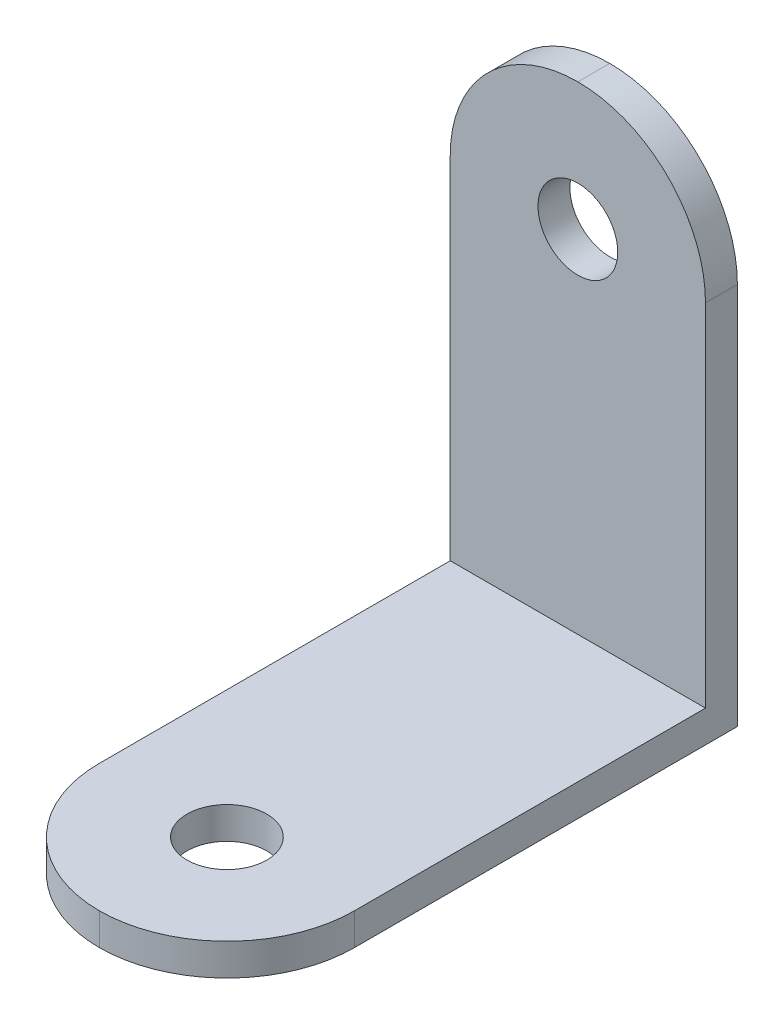
ISO-10303-21;
HEADER;
FILE_DESCRIPTION(('STEP AP214'),'2;1');
FILE_NAME('part.step','',(''),(''),'','','');
FILE_SCHEMA(('AUTOMOTIVE_DESIGN { 1 0 10303 214 1 1 1 1 }'));
ENDSEC;
DATA;
#1=APPLICATION_CONTEXT('core data for automotive mechanical design processes');
#2=APPLICATION_PROTOCOL_DEFINITION('international standard','automotive_design',2000,#1);
#3=PRODUCT_CONTEXT('',#1,'mechanical');
#4=PRODUCT('Part','Part','',(#3));
#5=PRODUCT_RELATED_PRODUCT_CATEGORY('part','',(#4));
#6=PRODUCT_DEFINITION_FORMATION('','',#4);
#7=PRODUCT_DEFINITION_CONTEXT('part definition',#1,'design');
#8=PRODUCT_DEFINITION('design','',#6,#7);
#9=PRODUCT_DEFINITION_SHAPE('','',#8);
#10=(LENGTH_UNIT() NAMED_UNIT(*) SI_UNIT(.MILLI.,.METRE.));
#11=(NAMED_UNIT(*) PLANE_ANGLE_UNIT() SI_UNIT($,.RADIAN.));
#12=(NAMED_UNIT(*) SI_UNIT($,.STERADIAN.) SOLID_ANGLE_UNIT());
#13=UNCERTAINTY_MEASURE_WITH_UNIT(LENGTH_MEASURE(1.E-05),#10,'distance_accuracy_value','');
#14=(GEOMETRIC_REPRESENTATION_CONTEXT(3) GLOBAL_UNCERTAINTY_ASSIGNED_CONTEXT((#13)) GLOBAL_UNIT_ASSIGNED_CONTEXT((#10,
#11,#12)) REPRESENTATION_CONTEXT('',''));
#15=CARTESIAN_POINT('',(0.,0.,0.));
#16=DIRECTION('',(0.,0.,1.));
#17=DIRECTION('',(1.,0.,0.));
#18=AXIS2_PLACEMENT_3D('',#15,#16,#17);
#19=CARTESIAN_POINT('',(0.,0.,30.));
#20=DIRECTION('',(1.,0.,0.));
#21=DIRECTION('',(0.,0.,-1.));
#22=AXIS2_PLACEMENT_3D('',#19,#20,#21);
#23=PLANE('',#22);
#24=DIRECTION('',(0.,-1.,0.));
#25=VECTOR('',#24,1.);
#26=CARTESIAN_POINT('',(0.,32.,0.));
#27=LINE('',#26,#25);
#28=CARTESIAN_POINT('',(0.,24.,0.));
#29=VERTEX_POINT('',#28);
#30=CARTESIAN_POINT('',(0.,2.,0.));
#31=VERTEX_POINT('',#30);
#32=EDGE_CURVE('E144',#29,#31,#27,.T.);
#33=ORIENTED_EDGE('',*,*,#32,.F.);
#34=DIRECTION('',(0.,0.,1.));
#35=VECTOR('',#34,1.);
#36=CARTESIAN_POINT('',(0.,24.,30.));
#37=LINE('',#36,#35);
#38=CARTESIAN_POINT('',(0.,24.,-2.));
#39=VERTEX_POINT('',#38);
#40=EDGE_CURVE('E48',#29,#39,#37,.F.);
#41=ORIENTED_EDGE('',*,*,#40,.T.);
#42=DIRECTION('',(0.,-1.,0.));
#43=VECTOR('',#42,1.);
#44=CARTESIAN_POINT('',(0.,32.,-2.));
#45=LINE('',#44,#43);
#46=CARTESIAN_POINT('',(0.,0.,-2.));
#47=VERTEX_POINT('',#46);
#48=EDGE_CURVE('E114',#39,#47,#45,.T.);
#49=ORIENTED_EDGE('',*,*,#48,.T.);
#50=DIRECTION('',(0.,0.,-1.));
#51=VECTOR('',#50,1.);
#52=CARTESIAN_POINT('',(0.,0.,30.));
#53=LINE('',#52,#51);
#54=CARTESIAN_POINT('',(0.,0.,22.));
#55=VERTEX_POINT('',#54);
#56=EDGE_CURVE('E125',#55,#47,#53,.T.);
#57=ORIENTED_EDGE('',*,*,#56,.F.);
#58=DIRECTION('',(0.,-1.,0.));
#59=VECTOR('',#58,1.);
#60=CARTESIAN_POINT('',(0.,0.,22.));
#61=LINE('',#60,#59);
#62=CARTESIAN_POINT('',(0.,2.,22.));
#63=VERTEX_POINT('',#62);
#64=EDGE_CURVE('E167',#55,#63,#61,.F.);
#65=ORIENTED_EDGE('',*,*,#64,.T.);
#66=DIRECTION('',(0.,0.,-1.));
#67=VECTOR('',#66,1.);
#68=CARTESIAN_POINT('',(0.,2.,30.));
#69=LINE('',#68,#67);
#70=EDGE_CURVE('E151',#63,#31,#69,.T.);
#71=ORIENTED_EDGE('',*,*,#70,.T.);
#72=EDGE_LOOP('',(#33,#41,#49,#57,#65,#71));
#73=FACE_BOUND('',#72,.T.);
#74=ADVANCED_FACE('F39',(#73),#23,.F.);
#75=CARTESIAN_POINT('',(0.,0.,30.));
#76=DIRECTION('',(0.,1.,0.));
#77=DIRECTION('',(0.,0.,1.));
#78=AXIS2_PLACEMENT_3D('',#75,#76,#77);
#79=PLANE('',#78);
#80=CARTESIAN_POINT('',(8.,0.,22.));
#81=DIRECTION('',(0.,1.,0.));
#82=DIRECTION('',(0.,0.,1.));
#83=AXIS2_PLACEMENT_3D('',#80,#81,#82);
#84=CIRCLE('',#83,2.5);
#85=CARTESIAN_POINT('',(8.,0.,24.5));
#86=VERTEX_POINT('',#85);
#87=EDGE_CURVE('E132',#86,#86,#84,.T.);
#88=ORIENTED_EDGE('',*,*,#87,.T.);
#89=EDGE_LOOP('',(#88));
#90=FACE_BOUND('',#89,.T.);
#91=DIRECTION('',(0.,0.,-1.));
#92=VECTOR('',#91,1.);
#93=CARTESIAN_POINT('',(16.,0.,30.));
#94=LINE('',#93,#92);
#95=CARTESIAN_POINT('',(16.,0.,22.));
#96=VERTEX_POINT('',#95);
#97=CARTESIAN_POINT('',(16.,0.,-2.));
#98=VERTEX_POINT('',#97);
#99=EDGE_CURVE('E117',#96,#98,#94,.T.);
#100=ORIENTED_EDGE('',*,*,#99,.F.);
#101=CARTESIAN_POINT('',(8.,0.,22.));
#102=DIRECTION('',(0.,1.,0.));
#103=DIRECTION('',(0.,0.,1.));
#104=AXIS2_PLACEMENT_3D('',#101,#102,#103);
#105=CIRCLE('',#104,8.);
#106=CARTESIAN_POINT('',(8.,0.,30.));
#107=VERTEX_POINT('',#106);
#108=EDGE_CURVE('E179',#96,#107,#105,.F.);
#109=ORIENTED_EDGE('',*,*,#108,.T.);
#110=CARTESIAN_POINT('',(8.,0.,22.));
#111=DIRECTION('',(0.,1.,0.));
#112=DIRECTION('',(0.,0.,1.));
#113=AXIS2_PLACEMENT_3D('',#110,#111,#112);
#114=CIRCLE('',#113,8.);
#115=EDGE_CURVE('E164',#107,#55,#114,.F.);
#116=ORIENTED_EDGE('',*,*,#115,.T.);
#117=ORIENTED_EDGE('',*,*,#56,.T.);
#118=DIRECTION('',(-1.,0.,0.));
#119=VECTOR('',#118,1.);
#120=CARTESIAN_POINT('',(0.,0.,-2.));
#121=LINE('',#120,#119);
#122=EDGE_CURVE('E107',#98,#47,#121,.T.);
#123=ORIENTED_EDGE('',*,*,#122,.F.);
#124=EDGE_LOOP('',(#100,#109,#116,#117,#123));
#125=FACE_BOUND('',#124,.T.);
#126=ADVANCED_FACE('F129',(#90,#125),#79,.F.);
#127=CARTESIAN_POINT('',(16.,0.,30.));
#128=DIRECTION('',(-1.,0.,0.));
#129=DIRECTION('',(0.,0.,1.));
#130=AXIS2_PLACEMENT_3D('',#127,#128,#129);
#131=PLANE('',#130);
#132=DIRECTION('',(0.,-1.,0.));
#133=VECTOR('',#132,1.);
#134=CARTESIAN_POINT('',(16.,32.,-2.));
#135=LINE('',#134,#133);
#136=CARTESIAN_POINT('',(16.,24.,-2.));
#137=VERTEX_POINT('',#136);
#138=EDGE_CURVE('E103',#137,#98,#135,.T.);
#139=ORIENTED_EDGE('',*,*,#138,.F.);
#140=DIRECTION('',(0.,0.,-1.));
#141=VECTOR('',#140,1.);
#142=CARTESIAN_POINT('',(16.,24.,30.));
#143=LINE('',#142,#141);
#144=CARTESIAN_POINT('',(16.,24.,0.));
#145=VERTEX_POINT('',#144);
#146=EDGE_CURVE('E188',#137,#145,#143,.F.);
#147=ORIENTED_EDGE('',*,*,#146,.T.);
#148=DIRECTION('',(0.,-1.,0.));
#149=VECTOR('',#148,1.);
#150=CARTESIAN_POINT('',(16.,32.,0.));
#151=LINE('',#150,#149);
#152=CARTESIAN_POINT('',(16.,2.,0.));
#153=VERTEX_POINT('',#152);
#154=EDGE_CURVE('E113',#145,#153,#151,.T.);
#155=ORIENTED_EDGE('',*,*,#154,.T.);
#156=DIRECTION('',(0.,0.,-1.));
#157=VECTOR('',#156,1.);
#158=CARTESIAN_POINT('',(16.,2.,30.));
#159=LINE('',#158,#157);
#160=CARTESIAN_POINT('',(16.,2.,22.));
#161=VERTEX_POINT('',#160);
#162=EDGE_CURVE('E126',#161,#153,#159,.T.);
#163=ORIENTED_EDGE('',*,*,#162,.F.);
#164=DIRECTION('',(0.,1.,0.));
#165=VECTOR('',#164,1.);
#166=CARTESIAN_POINT('',(16.,0.,22.));
#167=LINE('',#166,#165);
#168=EDGE_CURVE('E121',#161,#96,#167,.F.);
#169=ORIENTED_EDGE('',*,*,#168,.T.);
#170=ORIENTED_EDGE('',*,*,#99,.T.);
#171=EDGE_LOOP('',(#139,#147,#155,#163,#169,#170));
#172=FACE_BOUND('',#171,.T.);
#173=ADVANCED_FACE('F118',(#172),#131,.F.);
#174=CARTESIAN_POINT('',(0.,2.,30.));
#175=DIRECTION('',(0.,-1.,0.));
#176=DIRECTION('',(0.,0.,-1.));
#177=AXIS2_PLACEMENT_3D('',#174,#175,#176);
#178=PLANE('',#177);
#179=CARTESIAN_POINT('',(8.,2.,22.));
#180=DIRECTION('',(0.,1.,0.));
#181=DIRECTION('',(0.,0.,1.));
#182=AXIS2_PLACEMENT_3D('',#179,#180,#181);
#183=CIRCLE('',#182,2.5);
#184=CARTESIAN_POINT('',(8.,2.,24.5));
#185=VERTEX_POINT('',#184);
#186=EDGE_CURVE('E138',#185,#185,#183,.T.);
#187=ORIENTED_EDGE('',*,*,#186,.F.);
#188=EDGE_LOOP('',(#187));
#189=FACE_BOUND('',#188,.T.);
#190=CARTESIAN_POINT('',(8.,2.,22.));
#191=DIRECTION('',(0.,-1.,0.));
#192=DIRECTION('',(0.,0.,-1.));
#193=AXIS2_PLACEMENT_3D('',#190,#191,#192);
#194=CIRCLE('',#193,8.);
#195=CARTESIAN_POINT('',(8.,2.,30.));
#196=VERTEX_POINT('',#195);
#197=EDGE_CURVE('E170',#63,#196,#194,.F.);
#198=ORIENTED_EDGE('',*,*,#197,.T.);
#199=CARTESIAN_POINT('',(8.,2.,22.));
#200=DIRECTION('',(0.,-1.,0.));
#201=DIRECTION('',(0.,0.,-1.));
#202=AXIS2_PLACEMENT_3D('',#199,#200,#201);
#203=CIRCLE('',#202,8.);
#204=EDGE_CURVE('E174',#196,#161,#203,.F.);
#205=ORIENTED_EDGE('',*,*,#204,.T.);
#206=ORIENTED_EDGE('',*,*,#162,.T.);
#207=DIRECTION('',(-1.,0.,0.));
#208=VECTOR('',#207,1.);
#209=CARTESIAN_POINT('',(0.,2.,0.));
#210=LINE('',#209,#208);
#211=EDGE_CURVE('E147',#153,#31,#210,.T.);
#212=ORIENTED_EDGE('',*,*,#211,.T.);
#213=ORIENTED_EDGE('',*,*,#70,.F.);
#214=EDGE_LOOP('',(#198,#205,#206,#212,#213));
#215=FACE_BOUND('',#214,.T.);
#216=ADVANCED_FACE('F213',(#189,#215),#178,.F.);
#217=CARTESIAN_POINT('',(8.,0.,22.));
#218=DIRECTION('',(0.,-1.,0.));
#219=DIRECTION('',(0.,0.,-1.));
#220=AXIS2_PLACEMENT_3D('',#217,#218,#219);
#221=CYLINDRICAL_SURFACE('',#220,8.);
#222=ORIENTED_EDGE('',*,*,#197,.F.);
#223=ORIENTED_EDGE('',*,*,#64,.F.);
#224=ORIENTED_EDGE('',*,*,#115,.F.);
#225=DIRECTION('',(0.,-1.,0.));
#226=VECTOR('',#225,1.);
#227=CARTESIAN_POINT('',(8.,0.,30.));
#228=LINE('',#227,#226);
#229=EDGE_CURVE('E160',#196,#107,#228,.T.);
#230=ORIENTED_EDGE('',*,*,#229,.F.);
#231=EDGE_LOOP('',(#222,#223,#224,#230));
#232=FACE_BOUND('',#231,.T.);
#233=ADVANCED_FACE('F210',(#232),#221,.T.);
#234=CARTESIAN_POINT('',(8.,0.,22.));
#235=DIRECTION('',(0.,1.,0.));
#236=DIRECTION('',(0.,0.,1.));
#237=AXIS2_PLACEMENT_3D('',#234,#235,#236);
#238=CYLINDRICAL_SURFACE('',#237,8.);
#239=ORIENTED_EDGE('',*,*,#108,.F.);
#240=ORIENTED_EDGE('',*,*,#168,.F.);
#241=ORIENTED_EDGE('',*,*,#204,.F.);
#242=ORIENTED_EDGE('',*,*,#229,.T.);
#243=EDGE_LOOP('',(#239,#240,#241,#242));
#244=FACE_BOUND('',#243,.T.);
#245=ADVANCED_FACE('F215',(#244),#238,.T.);
#246=CARTESIAN_POINT('',(0.,32.,0.));
#247=DIRECTION('',(0.,0.,-1.));
#248=DIRECTION('',(-1.,0.,0.));
#249=AXIS2_PLACEMENT_3D('',#246,#247,#248);
#250=PLANE('',#249);
#251=CARTESIAN_POINT('',(8.,24.,0.));
#252=DIRECTION('',(0.,0.,1.));
#253=DIRECTION('',(1.,0.,0.));
#254=AXIS2_PLACEMENT_3D('',#251,#252,#253);
#255=CIRCLE('',#254,2.5);
#256=CARTESIAN_POINT('',(10.5,24.,0.));
#257=VERTEX_POINT('',#256);
#258=EDGE_CURVE('E256',#257,#257,#255,.T.);
#259=ORIENTED_EDGE('',*,*,#258,.F.);
#260=EDGE_LOOP('',(#259));
#261=FACE_BOUND('',#260,.T.);
#262=CARTESIAN_POINT('',(8.,24.,0.));
#263=DIRECTION('',(0.,0.,-1.));
#264=DIRECTION('',(-1.,0.,0.));
#265=AXIS2_PLACEMENT_3D('',#262,#263,#264);
#266=CIRCLE('',#265,8.);
#267=CARTESIAN_POINT('',(8.,32.,0.));
#268=VERTEX_POINT('',#267);
#269=EDGE_CURVE('E191',#145,#268,#266,.F.);
#270=ORIENTED_EDGE('',*,*,#269,.T.);
#271=CARTESIAN_POINT('',(8.,24.,0.));
#272=DIRECTION('',(0.,0.,-1.));
#273=DIRECTION('',(-1.,0.,0.));
#274=AXIS2_PLACEMENT_3D('',#271,#272,#273);
#275=CIRCLE('',#274,8.);
#276=EDGE_CURVE('E62',#268,#29,#275,.F.);
#277=ORIENTED_EDGE('',*,*,#276,.T.);
#278=ORIENTED_EDGE('',*,*,#32,.T.);
#279=ORIENTED_EDGE('',*,*,#211,.F.);
#280=ORIENTED_EDGE('',*,*,#154,.F.);
#281=EDGE_LOOP('',(#270,#277,#278,#279,#280));
#282=FACE_BOUND('',#281,.T.);
#283=ADVANCED_FACE('F199',(#261,#282),#250,.F.);
#284=CARTESIAN_POINT('',(0.,32.,-2.));
#285=DIRECTION('',(0.,0.,1.));
#286=DIRECTION('',(1.,0.,0.));
#287=AXIS2_PLACEMENT_3D('',#284,#285,#286);
#288=PLANE('',#287);
#289=CARTESIAN_POINT('',(8.,24.,-2.));
#290=DIRECTION('',(0.,0.,1.));
#291=DIRECTION('',(1.,0.,0.));
#292=AXIS2_PLACEMENT_3D('',#289,#290,#291);
#293=CIRCLE('',#292,2.5);
#294=CARTESIAN_POINT('',(10.5,24.,-2.));
#295=VERTEX_POINT('',#294);
#296=EDGE_CURVE('E253',#295,#295,#293,.T.);
#297=ORIENTED_EDGE('',*,*,#296,.T.);
#298=EDGE_LOOP('',(#297));
#299=FACE_BOUND('',#298,.T.);
#300=ORIENTED_EDGE('',*,*,#48,.F.);
#301=CARTESIAN_POINT('',(8.,24.,-2.));
#302=DIRECTION('',(0.,0.,1.));
#303=DIRECTION('',(1.,0.,0.));
#304=AXIS2_PLACEMENT_3D('',#301,#302,#303);
#305=CIRCLE('',#304,8.);
#306=CARTESIAN_POINT('',(8.,32.,-2.));
#307=VERTEX_POINT('',#306);
#308=EDGE_CURVE('E11',#39,#307,#305,.F.);
#309=ORIENTED_EDGE('',*,*,#308,.T.);
#310=CARTESIAN_POINT('',(8.,24.,-2.));
#311=DIRECTION('',(0.,0.,1.));
#312=DIRECTION('',(1.,0.,0.));
#313=AXIS2_PLACEMENT_3D('',#310,#311,#312);
#314=CIRCLE('',#313,8.);
#315=EDGE_CURVE('E109',#307,#137,#314,.F.);
#316=ORIENTED_EDGE('',*,*,#315,.T.);
#317=ORIENTED_EDGE('',*,*,#138,.T.);
#318=ORIENTED_EDGE('',*,*,#122,.T.);
#319=EDGE_LOOP('',(#300,#309,#316,#317,#318));
#320=FACE_BOUND('',#319,.T.);
#321=ADVANCED_FACE('F105',(#299,#320),#288,.F.);
#322=CARTESIAN_POINT('',(8.,24.,0.));
#323=DIRECTION('',(0.,0.,-1.));
#324=DIRECTION('',(-1.,0.,0.));
#325=AXIS2_PLACEMENT_3D('',#322,#323,#324);
#326=CYLINDRICAL_SURFACE('',#325,8.);
#327=ORIENTED_EDGE('',*,*,#269,.F.);
#328=ORIENTED_EDGE('',*,*,#146,.F.);
#329=ORIENTED_EDGE('',*,*,#315,.F.);
#330=DIRECTION('',(0.,0.,-1.));
#331=VECTOR('',#330,1.);
#332=CARTESIAN_POINT('',(8.,32.,0.));
#333=LINE('',#332,#331);
#334=EDGE_CURVE('E182',#268,#307,#333,.T.);
#335=ORIENTED_EDGE('',*,*,#334,.F.);
#336=EDGE_LOOP('',(#327,#328,#329,#335));
#337=FACE_BOUND('',#336,.T.);
#338=ADVANCED_FACE('F202',(#337),#326,.T.);
#339=CARTESIAN_POINT('',(8.,24.,0.));
#340=DIRECTION('',(0.,0.,1.));
#341=DIRECTION('',(1.,0.,0.));
#342=AXIS2_PLACEMENT_3D('',#339,#340,#341);
#343=CYLINDRICAL_SURFACE('',#342,8.);
#344=ORIENTED_EDGE('',*,*,#308,.F.);
#345=ORIENTED_EDGE('',*,*,#40,.F.);
#346=ORIENTED_EDGE('',*,*,#276,.F.);
#347=ORIENTED_EDGE('',*,*,#334,.T.);
#348=EDGE_LOOP('',(#344,#345,#346,#347));
#349=FACE_BOUND('',#348,.T.);
#350=ADVANCED_FACE('F41',(#349),#343,.T.);
#351=CARTESIAN_POINT('',(8.,0.,22.));
#352=DIRECTION('',(0.,1.,0.));
#353=DIRECTION('',(0.,0.,1.));
#354=AXIS2_PLACEMENT_3D('',#351,#352,#353);
#355=CYLINDRICAL_SURFACE('',#354,2.5);
#356=ORIENTED_EDGE('',*,*,#87,.F.);
#357=EDGE_LOOP('',(#356));
#358=FACE_BOUND('',#357,.T.);
#359=ORIENTED_EDGE('',*,*,#186,.T.);
#360=EDGE_LOOP('',(#359));
#361=FACE_BOUND('',#360,.T.);
#362=ADVANCED_FACE('F241',(#358,#361),#355,.F.);
#363=CARTESIAN_POINT('',(8.,24.,-2.));
#364=DIRECTION('',(0.,0.,1.));
#365=DIRECTION('',(1.,0.,0.));
#366=AXIS2_PLACEMENT_3D('',#363,#364,#365);
#367=CYLINDRICAL_SURFACE('',#366,2.5);
#368=ORIENTED_EDGE('',*,*,#296,.F.);
#369=EDGE_LOOP('',(#368));
#370=FACE_BOUND('',#369,.T.);
#371=ORIENTED_EDGE('',*,*,#258,.T.);
#372=EDGE_LOOP('',(#371));
#373=FACE_BOUND('',#372,.T.);
#374=ADVANCED_FACE('F244',(#370,#373),#367,.F.);
#375=CLOSED_SHELL('',(#74,#126,#173,#216,#233,#245,#283,#321,#338,#350,#362,#374));
#376=MANIFOLD_SOLID_BREP('B2',#375);
#377=ADVANCED_BREP_SHAPE_REPRESENTATION('',(#18,#376),#14);
#378=SHAPE_DEFINITION_REPRESENTATION(#9,#377);
ENDSEC;
END-ISO-10303-21;
